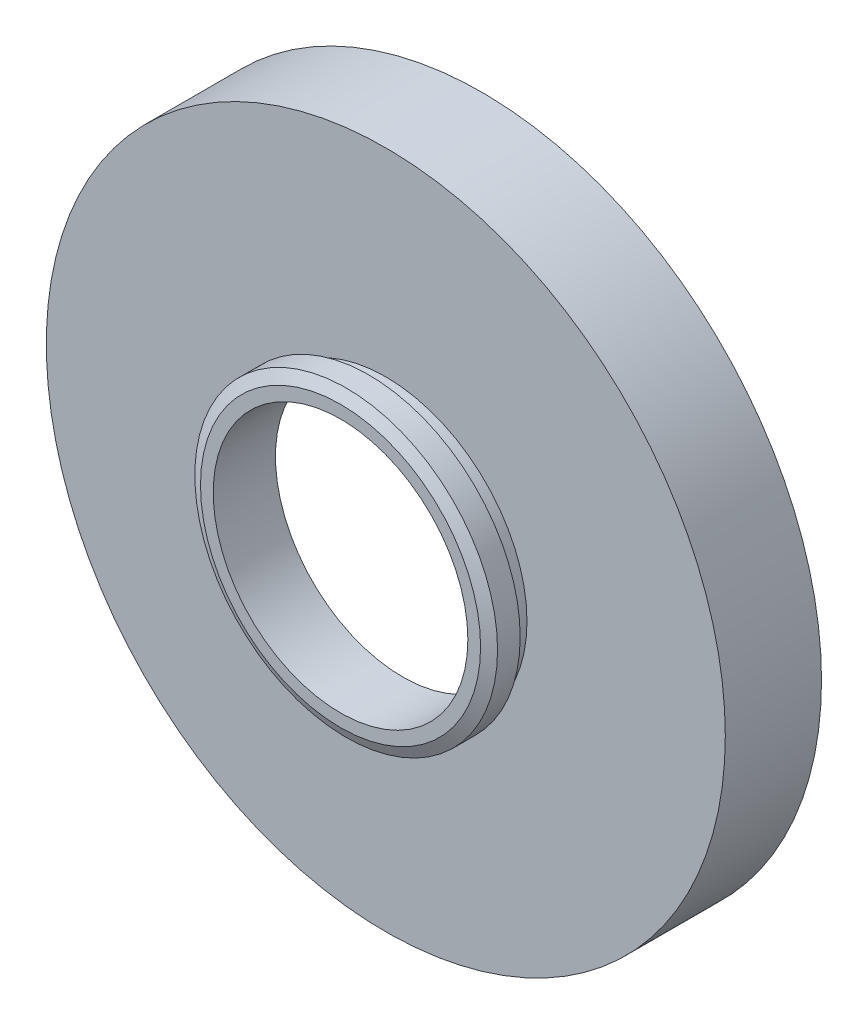
ISO-10303-21;
HEADER;
FILE_DESCRIPTION(('STEP AP214'),'2;1');
FILE_NAME('part.step','',(''),(''),'','','');
FILE_SCHEMA(('AUTOMOTIVE_DESIGN { 1 0 10303 214 1 1 1 1 }'));
ENDSEC;
DATA;
#1=APPLICATION_CONTEXT('core data for automotive mechanical design processes');
#2=APPLICATION_PROTOCOL_DEFINITION('international standard','automotive_design',2000,#1);
#3=PRODUCT_CONTEXT('',#1,'mechanical');
#4=PRODUCT('Part','Part','',(#3));
#5=PRODUCT_RELATED_PRODUCT_CATEGORY('part','',(#4));
#6=PRODUCT_DEFINITION_FORMATION('','',#4);
#7=PRODUCT_DEFINITION_CONTEXT('part definition',#1,'design');
#8=PRODUCT_DEFINITION('design','',#6,#7);
#9=PRODUCT_DEFINITION_SHAPE('','',#8);
#10=(LENGTH_UNIT() NAMED_UNIT(*) SI_UNIT(.MILLI.,.METRE.));
#11=(NAMED_UNIT(*) PLANE_ANGLE_UNIT() SI_UNIT($,.RADIAN.));
#12=(NAMED_UNIT(*) SI_UNIT($,.STERADIAN.) SOLID_ANGLE_UNIT());
#13=UNCERTAINTY_MEASURE_WITH_UNIT(LENGTH_MEASURE(1.E-05),#10,'distance_accuracy_value','');
#14=(GEOMETRIC_REPRESENTATION_CONTEXT(3) GLOBAL_UNCERTAINTY_ASSIGNED_CONTEXT((#13)) GLOBAL_UNIT_ASSIGNED_CONTEXT((#10,
#11,#12)) REPRESENTATION_CONTEXT('',''));
#15=CARTESIAN_POINT('',(0.,0.,0.));
#16=DIRECTION('',(0.,0.,1.));
#17=DIRECTION('',(1.,0.,0.));
#18=AXIS2_PLACEMENT_3D('',#15,#16,#17);
#19=CARTESIAN_POINT('',(-64.4111422248557,-32.655071915301,34.4427478423636));
#20=DIRECTION('',(0.,0.,1.));
#21=DIRECTION('',(1.,0.,0.));
#22=AXIS2_PLACEMENT_3D('',#19,#20,#21);
#23=PLANE('',#22);
#24=CARTESIAN_POINT('',(-64.4111422248557,1.01434944093626,34.4427478423636));
#25=DIRECTION('',(0.,0.,1.));
#26=DIRECTION('',(1.,0.,0.));
#27=AXIS2_PLACEMENT_3D('',#24,#25,#26);
#28=CIRCLE('',#27,15.24);
#29=CARTESIAN_POINT('',(-49.1711422248557,1.01434944093626,34.4427478423636));
#30=VERTEX_POINT('',#29);
#31=EDGE_CURVE('E34',#30,#30,#28,.T.);
#32=ORIENTED_EDGE('',*,*,#31,.T.);
#33=EDGE_LOOP('',(#32));
#34=FACE_BOUND('',#33,.T.);
#35=CARTESIAN_POINT('',(-64.4111422248557,1.01434944093626,34.4427478423636));
#36=DIRECTION('',(0.,0.,1.));
#37=DIRECTION('',(1.,0.,0.));
#38=AXIS2_PLACEMENT_3D('',#35,#36,#37);
#39=CIRCLE('',#38,6.3373);
#40=CARTESIAN_POINT('',(-58.0738422248557,1.01434944093626,34.4427478423636));
#41=VERTEX_POINT('',#40);
#42=EDGE_CURVE('E53',#41,#41,#39,.T.);
#43=ORIENTED_EDGE('',*,*,#42,.F.);
#44=EDGE_LOOP('',(#43));
#45=FACE_BOUND('',#44,.T.);
#46=ADVANCED_FACE('F14',(#34,#45),#23,.T.);
#47=CARTESIAN_POINT('',(-64.4111422248557,1.01434944093626,33.6807478423636));
#48=DIRECTION('',(0.,0.,1.));
#49=DIRECTION('',(1.,0.,0.));
#50=AXIS2_PLACEMENT_3D('',#47,#48,#49);
#51=PLANE('',#50);
#52=CARTESIAN_POINT('',(-64.4111422248557,1.01434944093626,33.6807478423636));
#53=DIRECTION('',(0.,0.,1.));
#54=DIRECTION('',(1.,0.,0.));
#55=AXIS2_PLACEMENT_3D('',#52,#53,#54);
#56=CIRCLE('',#55,12.8016);
#57=CARTESIAN_POINT('',(-51.6095422248557,1.01434944093626,33.6807478423636));
#58=VERTEX_POINT('',#57);
#59=EDGE_CURVE('E38',#58,#58,#56,.T.);
#60=ORIENTED_EDGE('',*,*,#59,.F.);
#61=EDGE_LOOP('',(#60));
#62=FACE_BOUND('',#61,.T.);
#63=CARTESIAN_POINT('',(-64.4111422248557,1.01434944093626,33.6807478423636));
#64=DIRECTION('',(0.,0.,1.));
#65=DIRECTION('',(1.,0.,0.));
#66=AXIS2_PLACEMENT_3D('',#63,#64,#65);
#67=CIRCLE('',#66,5.715);
#68=CARTESIAN_POINT('',(-58.6961422248557,1.01434944093626,33.6807478423636));
#69=VERTEX_POINT('',#68);
#70=EDGE_CURVE('E35',#69,#69,#67,.F.);
#71=ORIENTED_EDGE('',*,*,#70,.F.);
#72=EDGE_LOOP('',(#71));
#73=FACE_BOUND('',#72,.T.);
#74=ADVANCED_FACE('F69',(#62,#73),#51,.F.);
#75=CARTESIAN_POINT('',(-64.4111422248557,-32.655071915301,30.1247478423636));
#76=DIRECTION('',(0.,0.,1.));
#77=DIRECTION('',(1.,0.,0.));
#78=AXIS2_PLACEMENT_3D('',#75,#76,#77);
#79=PLANE('',#78);
#80=CARTESIAN_POINT('',(-64.4111422248557,1.01434944093626,30.1247478423636));
#81=DIRECTION('',(0.,0.,1.));
#82=DIRECTION('',(1.,0.,0.));
#83=AXIS2_PLACEMENT_3D('',#80,#81,#82);
#84=CIRCLE('',#83,13.2415409051225);
#85=CARTESIAN_POINT('',(-51.1696013197332,1.01434944093626,30.1247478423636));
#86=VERTEX_POINT('',#85);
#87=EDGE_CURVE('E29',#86,#86,#84,.T.);
#88=ORIENTED_EDGE('',*,*,#87,.T.);
#89=EDGE_LOOP('',(#88));
#90=FACE_BOUND('',#89,.T.);
#91=CARTESIAN_POINT('',(-64.4111422248557,1.01434944093626,30.1247478423636));
#92=DIRECTION('',(0.,0.,1.));
#93=DIRECTION('',(1.,0.,0.));
#94=AXIS2_PLACEMENT_3D('',#91,#92,#93);
#95=CIRCLE('',#94,15.24);
#96=CARTESIAN_POINT('',(-49.1711422248557,1.01434944093626,30.1247478423636));
#97=VERTEX_POINT('',#96);
#98=EDGE_CURVE('E40',#97,#97,#95,.T.);
#99=ORIENTED_EDGE('',*,*,#98,.F.);
#100=EDGE_LOOP('',(#99));
#101=FACE_BOUND('',#100,.T.);
#102=ADVANCED_FACE('F78',(#90,#101),#79,.F.);
#103=CARTESIAN_POINT('',(-64.4111422248557,1.01434944093626,34.4427478423636));
#104=DIRECTION('',(0.,0.,-1.));
#105=DIRECTION('',(-1.,0.,0.));
#106=AXIS2_PLACEMENT_3D('',#103,#104,#105);
#107=CYLINDRICAL_SURFACE('',#106,15.24);
#108=ORIENTED_EDGE('',*,*,#31,.F.);
#109=EDGE_LOOP('',(#108));
#110=FACE_BOUND('',#109,.T.);
#111=ORIENTED_EDGE('',*,*,#98,.T.);
#112=EDGE_LOOP('',(#111));
#113=FACE_BOUND('',#112,.T.);
#114=ADVANCED_FACE('F86',(#110,#113),#107,.T.);
#115=CARTESIAN_POINT('',(-64.4111422248557,1.01434944093626,33.6807478423636));
#116=DIRECTION('',(0.,0.,-1.));
#117=DIRECTION('',(-1.,0.,0.));
#118=AXIS2_PLACEMENT_3D('',#115,#116,#117);
#119=CYLINDRICAL_SURFACE('',#118,12.8016);
#120=CARTESIAN_POINT('',(-64.4111422248557,1.01434944093626,30.3787478423636));
#121=DIRECTION('',(0.,0.,1.));
#122=DIRECTION('',(1.,0.,0.));
#123=AXIS2_PLACEMENT_3D('',#120,#121,#122);
#124=CIRCLE('',#123,12.8016);
#125=CARTESIAN_POINT('',(-51.6095422248557,1.01434944093626,30.3787478423636));
#126=VERTEX_POINT('',#125);
#127=EDGE_CURVE('E25',#126,#126,#124,.F.);
#128=ORIENTED_EDGE('',*,*,#127,.T.);
#129=EDGE_LOOP('',(#128));
#130=FACE_BOUND('',#129,.T.);
#131=ORIENTED_EDGE('',*,*,#59,.T.);
#132=EDGE_LOOP('',(#131));
#133=FACE_BOUND('',#132,.T.);
#134=ADVANCED_FACE('F83',(#130,#133),#119,.F.);
#135=CARTESIAN_POINT('',(-64.4111422248557,1.01434944093626,34.4427478423636));
#136=DIRECTION('',(0.,0.,-1.));
#137=DIRECTION('',(-1.,0.,0.));
#138=AXIS2_PLACEMENT_3D('',#135,#136,#137);
#139=CYLINDRICAL_SURFACE('',#138,5.715);
#140=ORIENTED_EDGE('',*,*,#70,.T.);
#141=EDGE_LOOP('',(#140));
#142=FACE_BOUND('',#141,.T.);
#143=CARTESIAN_POINT('',(-64.4111422248557,1.01434944093626,36.4747478423636));
#144=DIRECTION('',(0.,0.,1.));
#145=DIRECTION('',(1.,0.,0.));
#146=AXIS2_PLACEMENT_3D('',#143,#144,#145);
#147=CIRCLE('',#146,5.715);
#148=CARTESIAN_POINT('',(-58.6961422248557,1.01434944093626,36.4747478423636));
#149=VERTEX_POINT('',#148);
#150=EDGE_CURVE('E39',#149,#149,#147,.T.);
#151=ORIENTED_EDGE('',*,*,#150,.T.);
#152=EDGE_LOOP('',(#151));
#153=FACE_BOUND('',#152,.T.);
#154=ADVANCED_FACE('F106',(#142,#153),#139,.F.);
#155=CARTESIAN_POINT('',(-64.4111422248557,1.01434944093626,36.4747478423636));
#156=DIRECTION('',(0.,0.,1.));
#157=DIRECTION('',(1.,0.,0.));
#158=AXIS2_PLACEMENT_3D('',#155,#156,#157);
#159=PLANE('',#158);
#160=CARTESIAN_POINT('',(-64.4111422248557,1.01434944093626,36.4747478423636));
#161=DIRECTION('',(0.,0.,1.));
#162=DIRECTION('',(1.,0.,0.));
#163=AXIS2_PLACEMENT_3D('',#160,#161,#162);
#164=CIRCLE('',#163,6.2865);
#165=CARTESIAN_POINT('',(-58.1246422248557,1.01434944093626,36.4747478423636));
#166=VERTEX_POINT('',#165);
#167=EDGE_CURVE('E21',#166,#166,#164,.T.);
#168=ORIENTED_EDGE('',*,*,#167,.T.);
#169=EDGE_LOOP('',(#168));
#170=FACE_BOUND('',#169,.T.);
#171=ORIENTED_EDGE('',*,*,#150,.F.);
#172=EDGE_LOOP('',(#171));
#173=FACE_BOUND('',#172,.T.);
#174=ADVANCED_FACE('F113',(#170,#173),#159,.T.);
#175=CARTESIAN_POINT('',(-64.4111422248557,1.01434944093626,36.4747478423636));
#176=DIRECTION('',(0.,0.,-1.));
#177=DIRECTION('',(-1.,0.,0.));
#178=AXIS2_PLACEMENT_3D('',#175,#176,#177);
#179=CYLINDRICAL_SURFACE('',#178,6.7945);
#180=CARTESIAN_POINT('',(-64.4111422248557,1.01434944093626,36.2207478423636));
#181=DIRECTION('',(0.,0.,1.));
#182=DIRECTION('',(1.,0.,0.));
#183=AXIS2_PLACEMENT_3D('',#180,#181,#182);
#184=CIRCLE('',#183,6.7945);
#185=CARTESIAN_POINT('',(-57.6166422248557,1.01434944093626,36.2207478423636));
#186=VERTEX_POINT('',#185);
#187=EDGE_CURVE('E10',#186,#186,#184,.F.);
#188=ORIENTED_EDGE('',*,*,#187,.T.);
#189=EDGE_LOOP('',(#188));
#190=FACE_BOUND('',#189,.T.);
#191=CARTESIAN_POINT('',(-64.4111422248557,1.01434944093626,35.2047478423636));
#192=DIRECTION('',(0.,0.,1.));
#193=DIRECTION('',(1.,0.,0.));
#194=AXIS2_PLACEMENT_3D('',#191,#192,#193);
#195=CIRCLE('',#194,6.7945);
#196=CARTESIAN_POINT('',(-57.6166422248557,1.01434944093626,35.2047478423636));
#197=VERTEX_POINT('',#196);
#198=EDGE_CURVE('E49',#197,#197,#195,.T.);
#199=ORIENTED_EDGE('',*,*,#198,.T.);
#200=EDGE_LOOP('',(#199));
#201=FACE_BOUND('',#200,.T.);
#202=ADVANCED_FACE('F118',(#190,#201),#179,.T.);
#203=CARTESIAN_POINT('',(-64.4111422248557,1.01434944093626,35.2047478423636));
#204=DIRECTION('',(0.,0.,1.));
#205=DIRECTION('',(1.,0.,0.));
#206=AXIS2_PLACEMENT_3D('',#203,#204,#205);
#207=PLANE('',#206);
#208=ORIENTED_EDGE('',*,*,#198,.F.);
#209=EDGE_LOOP('',(#208));
#210=FACE_BOUND('',#209,.T.);
#211=CARTESIAN_POINT('',(-64.4111422248557,1.01434944093626,35.2047478423636));
#212=DIRECTION('',(0.,0.,1.));
#213=DIRECTION('',(1.,0.,0.));
#214=AXIS2_PLACEMENT_3D('',#211,#212,#213);
#215=CIRCLE('',#214,6.3373);
#216=CARTESIAN_POINT('',(-58.0738422248557,1.01434944093626,35.2047478423636));
#217=VERTEX_POINT('',#216);
#218=EDGE_CURVE('E52',#217,#217,#215,.T.);
#219=ORIENTED_EDGE('',*,*,#218,.T.);
#220=EDGE_LOOP('',(#219));
#221=FACE_BOUND('',#220,.T.);
#222=ADVANCED_FACE('F59',(#210,#221),#207,.F.);
#223=CARTESIAN_POINT('',(-64.4111422248557,1.01434944093626,35.2047478423636));
#224=DIRECTION('',(0.,0.,-1.));
#225=DIRECTION('',(-1.,0.,0.));
#226=AXIS2_PLACEMENT_3D('',#223,#224,#225);
#227=CYLINDRICAL_SURFACE('',#226,6.3373);
#228=ORIENTED_EDGE('',*,*,#218,.F.);
#229=EDGE_LOOP('',(#228));
#230=FACE_BOUND('',#229,.T.);
#231=ORIENTED_EDGE('',*,*,#42,.T.);
#232=EDGE_LOOP('',(#231));
#233=FACE_BOUND('',#232,.T.);
#234=ADVANCED_FACE('F61',(#230,#233),#227,.T.);
#235=CARTESIAN_POINT('',(-64.4111422248557,1.01434944093626,30.1247478423636));
#236=DIRECTION('',(0.,0.,-1.));
#237=DIRECTION('',(-1.,0.,0.));
#238=AXIS2_PLACEMENT_3D('',#235,#236,#237);
#239=CONICAL_SURFACE('',#238,13.2415409051225,1.04719755119659);
#240=ORIENTED_EDGE('',*,*,#127,.F.);
#241=EDGE_LOOP('',(#240));
#242=FACE_BOUND('',#241,.T.);
#243=ORIENTED_EDGE('',*,*,#87,.F.);
#244=EDGE_LOOP('',(#243));
#245=FACE_BOUND('',#244,.T.);
#246=ADVANCED_FACE('F64',(#242,#245),#239,.F.);
#247=CARTESIAN_POINT('',(-64.4111422248557,1.01434944093626,36.4747478423636));
#248=DIRECTION('',(0.,0.,-1.));
#249=DIRECTION('',(-1.,0.,0.));
#250=AXIS2_PLACEMENT_3D('',#247,#248,#249);
#251=CONICAL_SURFACE('',#250,6.2865,1.10714871779409);
#252=ORIENTED_EDGE('',*,*,#187,.F.);
#253=EDGE_LOOP('',(#252));
#254=FACE_BOUND('',#253,.T.);
#255=ORIENTED_EDGE('',*,*,#167,.F.);
#256=EDGE_LOOP('',(#255));
#257=FACE_BOUND('',#256,.T.);
#258=ADVANCED_FACE('F16',(#254,#257),#251,.T.);
#259=CLOSED_SHELL('',(#46,#74,#102,#114,#134,#154,#174,#202,#222,#234,#246,#258));
#260=MANIFOLD_SOLID_BREP('B1',#259);
#261=ADVANCED_BREP_SHAPE_REPRESENTATION('',(#18,#260),#14);
#262=SHAPE_DEFINITION_REPRESENTATION(#9,#261);
ENDSEC;
END-ISO-10303-21;
